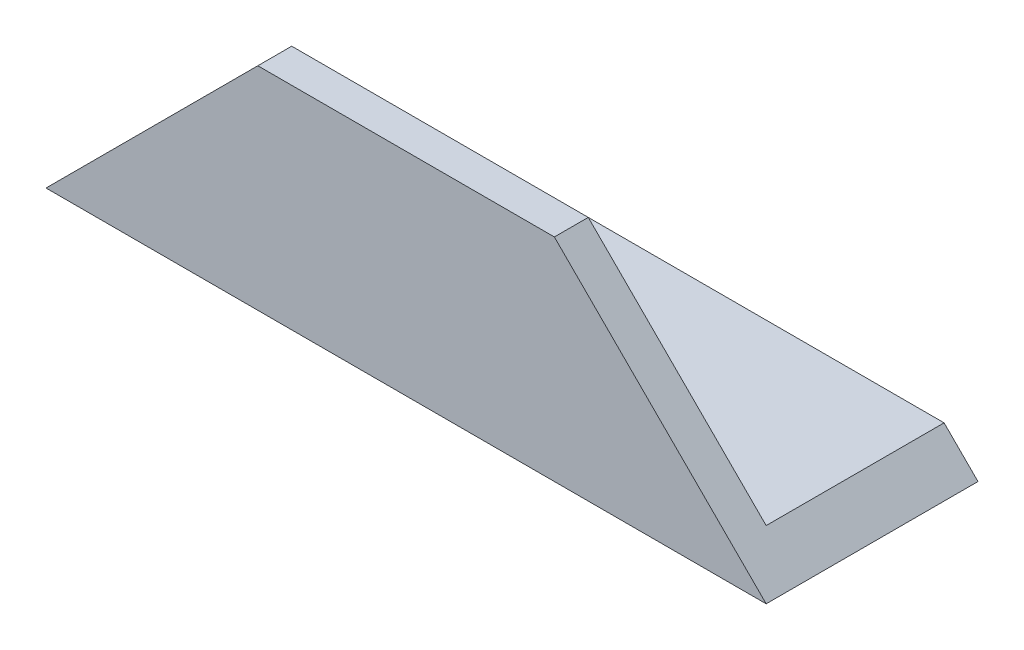
ISO-10303-21;
HEADER;
FILE_DESCRIPTION(('STEP AP214'),'2;1');
FILE_NAME('part.step','',(''),(''),'','','');
FILE_SCHEMA(('AUTOMOTIVE_DESIGN { 1 0 10303 214 1 1 1 1 }'));
ENDSEC;
DATA;
#1=APPLICATION_CONTEXT('core data for automotive mechanical design processes');
#2=APPLICATION_PROTOCOL_DEFINITION('international standard','automotive_design',2000,#1);
#3=PRODUCT_CONTEXT('',#1,'mechanical');
#4=PRODUCT('Part','Part','',(#3));
#5=PRODUCT_RELATED_PRODUCT_CATEGORY('part','',(#4));
#6=PRODUCT_DEFINITION_FORMATION('','',#4);
#7=PRODUCT_DEFINITION_CONTEXT('part definition',#1,'design');
#8=PRODUCT_DEFINITION('design','',#6,#7);
#9=PRODUCT_DEFINITION_SHAPE('','',#8);
#10=(LENGTH_UNIT() NAMED_UNIT(*) SI_UNIT(.MILLI.,.METRE.));
#11=(NAMED_UNIT(*) PLANE_ANGLE_UNIT() SI_UNIT($,.RADIAN.));
#12=(NAMED_UNIT(*) SI_UNIT($,.STERADIAN.) SOLID_ANGLE_UNIT());
#13=UNCERTAINTY_MEASURE_WITH_UNIT(LENGTH_MEASURE(1.E-05),#10,'distance_accuracy_value','');
#14=(GEOMETRIC_REPRESENTATION_CONTEXT(3) GLOBAL_UNCERTAINTY_ASSIGNED_CONTEXT((#13)) GLOBAL_UNIT_ASSIGNED_CONTEXT((#10,
#11,#12)) REPRESENTATION_CONTEXT('',''));
#15=CARTESIAN_POINT('',(0.,0.,0.));
#16=DIRECTION('',(0.,0.,1.));
#17=DIRECTION('',(1.,0.,0.));
#18=AXIS2_PLACEMENT_3D('',#15,#16,#17);
#19=CARTESIAN_POINT('',(85.,0.,-4.));
#20=DIRECTION('',(0.,0.,1.));
#21=DIRECTION('',(1.,0.,0.));
#22=AXIS2_PLACEMENT_3D('',#19,#20,#21);
#23=PLANE('',#22);
#24=DIRECTION('',(-1.,0.,0.));
#25=VECTOR('',#24,1.);
#26=CARTESIAN_POINT('',(85.,4.,-4.));
#27=LINE('',#26,#25);
#28=CARTESIAN_POINT('',(81.,4.,-4.));
#29=VERTEX_POINT('',#28);
#30=CARTESIAN_POINT('',(32.,4.,-4.));
#31=VERTEX_POINT('',#30);
#32=EDGE_CURVE('E120',#29,#31,#27,.T.);
#33=ORIENTED_EDGE('',*,*,#32,.T.);
#34=DIRECTION('',(0.,-1.,0.));
#35=VECTOR('',#34,1.);
#36=CARTESIAN_POINT('',(32.,10.,-4.));
#37=LINE('',#36,#35);
#38=CARTESIAN_POINT('',(32.,0.,-4.));
#39=VERTEX_POINT('',#38);
#40=EDGE_CURVE('E101',#31,#39,#37,.T.);
#41=ORIENTED_EDGE('',*,*,#40,.T.);
#42=DIRECTION('',(-1.,0.,0.));
#43=VECTOR('',#42,1.);
#44=CARTESIAN_POINT('',(0.,0.,-4.));
#45=LINE('',#44,#43);
#46=CARTESIAN_POINT('',(0.,0.,-4.));
#47=VERTEX_POINT('',#46);
#48=EDGE_CURVE('E102',#39,#47,#45,.T.);
#49=ORIENTED_EDGE('',*,*,#48,.T.);
#50=DIRECTION('',(0.707106781186551,0.707106781186544,0.));
#51=VECTOR('',#50,1.);
#52=CARTESIAN_POINT('',(42.5000000000005,42.5,-4.));
#53=LINE('',#52,#51);
#54=CARTESIAN_POINT('',(25.0000000000003,25.,-4.));
#55=VERTEX_POINT('',#54);
#56=EDGE_CURVE('E48',#47,#55,#53,.T.);
#57=ORIENTED_EDGE('',*,*,#56,.T.);
#58=DIRECTION('',(-1.,0.,0.));
#59=VECTOR('',#58,1.);
#60=CARTESIAN_POINT('',(85.,25.,-4.));
#61=LINE('',#60,#59);
#62=CARTESIAN_POINT('',(59.9999999999997,25.,-4.));
#63=VERTEX_POINT('',#62);
#64=EDGE_CURVE('E41',#63,#55,#61,.T.);
#65=ORIENTED_EDGE('',*,*,#64,.F.);
#66=DIRECTION('',(0.707106781186551,-0.707106781186544,0.));
#67=VECTOR('',#66,1.);
#68=CARTESIAN_POINT('',(85.,0.,-4.));
#69=LINE('',#68,#67);
#70=EDGE_CURVE('E142',#63,#29,#69,.T.);
#71=ORIENTED_EDGE('',*,*,#70,.T.);
#72=EDGE_LOOP('',(#33,#41,#49,#57,#65,#71));
#73=FACE_BOUND('',#72,.T.);
#74=ADVANCED_FACE('F34',(#73),#23,.F.);
#75=CARTESIAN_POINT('',(85.,25.,0.));
#76=DIRECTION('',(0.,1.,0.));
#77=DIRECTION('',(0.,0.,1.));
#78=AXIS2_PLACEMENT_3D('',#75,#76,#77);
#79=PLANE('',#78);
#80=DIRECTION('',(0.,0.,1.));
#81=VECTOR('',#80,1.);
#82=CARTESIAN_POINT('',(59.9999999999997,25.,-25.));
#83=LINE('',#82,#81);
#84=CARTESIAN_POINT('',(59.9999999999997,25.,0.));
#85=VERTEX_POINT('',#84);
#86=EDGE_CURVE('E132',#63,#85,#83,.T.);
#87=ORIENTED_EDGE('',*,*,#86,.F.);
#88=ORIENTED_EDGE('',*,*,#64,.T.);
#89=DIRECTION('',(0.,0.,1.));
#90=VECTOR('',#89,1.);
#91=CARTESIAN_POINT('',(25.0000000000003,25.,-25.));
#92=LINE('',#91,#90);
#93=CARTESIAN_POINT('',(25.0000000000003,25.,0.));
#94=VERTEX_POINT('',#93);
#95=EDGE_CURVE('E131',#55,#94,#92,.T.);
#96=ORIENTED_EDGE('',*,*,#95,.T.);
#97=DIRECTION('',(-1.,0.,0.));
#98=VECTOR('',#97,1.);
#99=CARTESIAN_POINT('',(85.,25.,0.));
#100=LINE('',#99,#98);
#101=EDGE_CURVE('E118',#85,#94,#100,.T.);
#102=ORIENTED_EDGE('',*,*,#101,.F.);
#103=EDGE_LOOP('',(#87,#88,#96,#102));
#104=FACE_BOUND('',#103,.T.);
#105=ADVANCED_FACE('F129',(#104),#79,.T.);
#106=CARTESIAN_POINT('',(85.,0.,0.));
#107=DIRECTION('',(0.,0.,1.));
#108=DIRECTION('',(1.,0.,0.));
#109=AXIS2_PLACEMENT_3D('',#106,#107,#108);
#110=PLANE('',#109);
#111=DIRECTION('',(0.707106781186551,-0.707106781186544,0.));
#112=VECTOR('',#111,1.);
#113=CARTESIAN_POINT('',(85.,0.,0.));
#114=LINE('',#113,#112);
#115=CARTESIAN_POINT('',(85.,0.,0.));
#116=VERTEX_POINT('',#115);
#117=EDGE_CURVE('E56',#85,#116,#114,.T.);
#118=ORIENTED_EDGE('',*,*,#117,.F.);
#119=ORIENTED_EDGE('',*,*,#101,.T.);
#120=DIRECTION('',(0.707106781186551,0.707106781186544,0.));
#121=VECTOR('',#120,1.);
#122=CARTESIAN_POINT('',(25.0000000000003,25.,0.));
#123=LINE('',#122,#121);
#124=CARTESIAN_POINT('',(0.,0.,0.));
#125=VERTEX_POINT('',#124);
#126=EDGE_CURVE('E138',#125,#94,#123,.T.);
#127=ORIENTED_EDGE('',*,*,#126,.F.);
#128=DIRECTION('',(-1.,0.,0.));
#129=VECTOR('',#128,1.);
#130=CARTESIAN_POINT('',(85.,0.,0.));
#131=LINE('',#130,#129);
#132=EDGE_CURVE('E114',#116,#125,#131,.T.);
#133=ORIENTED_EDGE('',*,*,#132,.F.);
#134=EDGE_LOOP('',(#118,#119,#127,#133));
#135=FACE_BOUND('',#134,.T.);
#136=ADVANCED_FACE('F161',(#135),#110,.T.);
#137=CARTESIAN_POINT('',(85.,0.,0.));
#138=DIRECTION('',(0.,-1.,0.));
#139=DIRECTION('',(0.,0.,-1.));
#140=AXIS2_PLACEMENT_3D('',#137,#138,#139);
#141=PLANE('',#140);
#142=ORIENTED_EDGE('',*,*,#48,.F.);
#143=DIRECTION('',(0.,0.,1.));
#144=VECTOR('',#143,1.);
#145=CARTESIAN_POINT('',(32.,0.,-25.));
#146=LINE('',#145,#144);
#147=CARTESIAN_POINT('',(32.,0.,-25.));
#148=VERTEX_POINT('',#147);
#149=EDGE_CURVE('E95',#148,#39,#146,.T.);
#150=ORIENTED_EDGE('',*,*,#149,.F.);
#151=DIRECTION('',(-1.,0.,0.));
#152=VECTOR('',#151,1.);
#153=CARTESIAN_POINT('',(85.,0.,-25.));
#154=LINE('',#153,#152);
#155=CARTESIAN_POINT('',(85.,0.,-25.));
#156=VERTEX_POINT('',#155);
#157=EDGE_CURVE('E108',#156,#148,#154,.T.);
#158=ORIENTED_EDGE('',*,*,#157,.F.);
#159=DIRECTION('',(0.,0.,1.));
#160=VECTOR('',#159,1.);
#161=CARTESIAN_POINT('',(85.,0.,0.));
#162=LINE('',#161,#160);
#163=EDGE_CURVE('E146',#156,#116,#162,.T.);
#164=ORIENTED_EDGE('',*,*,#163,.T.);
#165=ORIENTED_EDGE('',*,*,#132,.T.);
#166=DIRECTION('',(0.,0.,1.));
#167=VECTOR('',#166,1.);
#168=CARTESIAN_POINT('',(0.,0.,0.));
#169=LINE('',#168,#167);
#170=EDGE_CURVE('E140',#47,#125,#169,.T.);
#171=ORIENTED_EDGE('',*,*,#170,.F.);
#172=EDGE_LOOP('',(#142,#150,#158,#164,#165,#171));
#173=FACE_BOUND('',#172,.T.);
#174=ADVANCED_FACE('F106',(#173),#141,.T.);
#175=CARTESIAN_POINT('',(85.,4.,-25.));
#176=DIRECTION('',(0.,0.,-1.));
#177=DIRECTION('',(-1.,0.,0.));
#178=AXIS2_PLACEMENT_3D('',#175,#176,#177);
#179=PLANE('',#178);
#180=DIRECTION('',(0.,-1.,0.));
#181=VECTOR('',#180,1.);
#182=CARTESIAN_POINT('',(32.,10.,-25.));
#183=LINE('',#182,#181);
#184=CARTESIAN_POINT('',(32.,4.,-25.));
#185=VERTEX_POINT('',#184);
#186=EDGE_CURVE('E92',#185,#148,#183,.T.);
#187=ORIENTED_EDGE('',*,*,#186,.F.);
#188=DIRECTION('',(-1.,0.,0.));
#189=VECTOR('',#188,1.);
#190=CARTESIAN_POINT('',(85.,4.,-25.));
#191=LINE('',#190,#189);
#192=CARTESIAN_POINT('',(81.,4.,-25.));
#193=VERTEX_POINT('',#192);
#194=EDGE_CURVE('E115',#193,#185,#191,.T.);
#195=ORIENTED_EDGE('',*,*,#194,.F.);
#196=DIRECTION('',(0.707106781186551,-0.707106781186544,0.));
#197=VECTOR('',#196,1.);
#198=CARTESIAN_POINT('',(85.,0.,-25.));
#199=LINE('',#198,#197);
#200=EDGE_CURVE('E113',#193,#156,#199,.T.);
#201=ORIENTED_EDGE('',*,*,#200,.T.);
#202=ORIENTED_EDGE('',*,*,#157,.T.);
#203=EDGE_LOOP('',(#187,#195,#201,#202));
#204=FACE_BOUND('',#203,.T.);
#205=ADVANCED_FACE('F112',(#204),#179,.T.);
#206=CARTESIAN_POINT('',(85.,4.,0.));
#207=DIRECTION('',(0.,-1.,0.));
#208=DIRECTION('',(0.,0.,-1.));
#209=AXIS2_PLACEMENT_3D('',#206,#207,#208);
#210=PLANE('',#209);
#211=ORIENTED_EDGE('',*,*,#194,.T.);
#212=DIRECTION('',(0.,0.,1.));
#213=VECTOR('',#212,1.);
#214=CARTESIAN_POINT('',(32.,4.,0.));
#215=LINE('',#214,#213);
#216=EDGE_CURVE('E11',#185,#31,#215,.T.);
#217=ORIENTED_EDGE('',*,*,#216,.T.);
#218=ORIENTED_EDGE('',*,*,#32,.F.);
#219=DIRECTION('',(0.,0.,-1.));
#220=VECTOR('',#219,1.);
#221=CARTESIAN_POINT('',(81.,4.,0.));
#222=LINE('',#221,#220);
#223=EDGE_CURVE('E153',#29,#193,#222,.T.);
#224=ORIENTED_EDGE('',*,*,#223,.T.);
#225=EDGE_LOOP('',(#211,#217,#218,#224));
#226=FACE_BOUND('',#225,.T.);
#227=ADVANCED_FACE('F152',(#226),#210,.F.);
#228=CARTESIAN_POINT('',(25.0000000000003,25.,-25.));
#229=DIRECTION('',(0.707106781186544,-0.707106781186551,0.));
#230=DIRECTION('',(0.707106781186551,0.707106781186544,0.));
#231=AXIS2_PLACEMENT_3D('',#228,#229,#230);
#232=PLANE('',#231);
#233=ORIENTED_EDGE('',*,*,#56,.F.);
#234=ORIENTED_EDGE('',*,*,#170,.T.);
#235=ORIENTED_EDGE('',*,*,#126,.T.);
#236=ORIENTED_EDGE('',*,*,#95,.F.);
#237=EDGE_LOOP('',(#233,#234,#235,#236));
#238=FACE_BOUND('',#237,.T.);
#239=ADVANCED_FACE('F136',(#238),#232,.F.);
#240=CARTESIAN_POINT('',(85.,0.,-25.));
#241=DIRECTION('',(-0.707106781186544,-0.707106781186551,0.));
#242=DIRECTION('',(0.707106781186551,-0.707106781186544,0.));
#243=AXIS2_PLACEMENT_3D('',#240,#241,#242);
#244=PLANE('',#243);
#245=ORIENTED_EDGE('',*,*,#86,.T.);
#246=ORIENTED_EDGE('',*,*,#117,.T.);
#247=ORIENTED_EDGE('',*,*,#163,.F.);
#248=ORIENTED_EDGE('',*,*,#200,.F.);
#249=ORIENTED_EDGE('',*,*,#223,.F.);
#250=ORIENTED_EDGE('',*,*,#70,.F.);
#251=EDGE_LOOP('',(#245,#246,#247,#248,#249,#250));
#252=FACE_BOUND('',#251,.T.);
#253=ADVANCED_FACE('F162',(#252),#244,.F.);
#254=CARTESIAN_POINT('',(32.,10.,-25.));
#255=DIRECTION('',(1.,0.,0.));
#256=DIRECTION('',(0.,0.,-1.));
#257=AXIS2_PLACEMENT_3D('',#254,#255,#256);
#258=PLANE('',#257);
#259=ORIENTED_EDGE('',*,*,#186,.T.);
#260=ORIENTED_EDGE('',*,*,#149,.T.);
#261=ORIENTED_EDGE('',*,*,#40,.F.);
#262=ORIENTED_EDGE('',*,*,#216,.F.);
#263=EDGE_LOOP('',(#259,#260,#261,#262));
#264=FACE_BOUND('',#263,.T.);
#265=ADVANCED_FACE('F94',(#264),#258,.F.);
#266=CLOSED_SHELL('',(#74,#105,#136,#174,#205,#227,#239,#253,#265));
#267=MANIFOLD_SOLID_BREP('B2',#266);
#268=ADVANCED_BREP_SHAPE_REPRESENTATION('',(#18,#267),#14);
#269=SHAPE_DEFINITION_REPRESENTATION(#9,#268);
ENDSEC;
END-ISO-10303-21;
